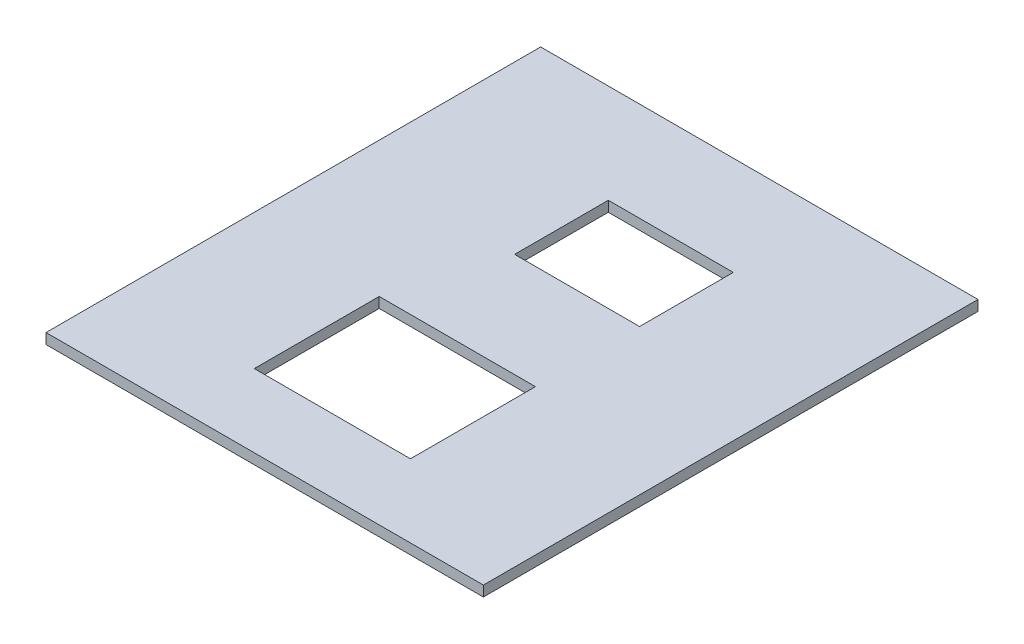
ISO-10303-21;
HEADER;
FILE_DESCRIPTION(('STEP AP214'),'2;1');
FILE_NAME('part.step','',(''),(''),'','','');
FILE_SCHEMA(('AUTOMOTIVE_DESIGN { 1 0 10303 214 1 1 1 1 }'));
ENDSEC;
DATA;
#1=APPLICATION_CONTEXT('core data for automotive mechanical design processes');
#2=APPLICATION_PROTOCOL_DEFINITION('international standard','automotive_design',2000,#1);
#3=PRODUCT_CONTEXT('',#1,'mechanical');
#4=PRODUCT('Part','Part','',(#3));
#5=PRODUCT_RELATED_PRODUCT_CATEGORY('part','',(#4));
#6=PRODUCT_DEFINITION_FORMATION('','',#4);
#7=PRODUCT_DEFINITION_CONTEXT('part definition',#1,'design');
#8=PRODUCT_DEFINITION('design','',#6,#7);
#9=PRODUCT_DEFINITION_SHAPE('','',#8);
#10=(LENGTH_UNIT() NAMED_UNIT(*) SI_UNIT(.MILLI.,.METRE.));
#11=(NAMED_UNIT(*) PLANE_ANGLE_UNIT() SI_UNIT($,.RADIAN.));
#12=(NAMED_UNIT(*) SI_UNIT($,.STERADIAN.) SOLID_ANGLE_UNIT());
#13=UNCERTAINTY_MEASURE_WITH_UNIT(LENGTH_MEASURE(1.E-05),#10,'distance_accuracy_value','');
#14=(GEOMETRIC_REPRESENTATION_CONTEXT(3) GLOBAL_UNCERTAINTY_ASSIGNED_CONTEXT((#13)) GLOBAL_UNIT_ASSIGNED_CONTEXT((#10,
#11,#12)) REPRESENTATION_CONTEXT('',''));
#15=CARTESIAN_POINT('',(0.,0.,0.));
#16=DIRECTION('',(0.,0.,1.));
#17=DIRECTION('',(1.,0.,0.));
#18=AXIS2_PLACEMENT_3D('',#15,#16,#17);
#19=CARTESIAN_POINT('',(0.,1.,0.));
#20=DIRECTION('',(0.,-1.,0.));
#21=DIRECTION('',(0.,0.,-1.));
#22=AXIS2_PLACEMENT_3D('',#19,#20,#21);
#23=PLANE('',#22);
#24=DIRECTION('',(0.,0.,1.));
#25=VECTOR('',#24,1.);
#26=CARTESIAN_POINT('',(-5.,1.,0.));
#27=LINE('',#26,#25);
#28=CARTESIAN_POINT('',(-5.,1.,-14.25));
#29=VERTEX_POINT('',#28);
#30=CARTESIAN_POINT('',(-5.,1.,-5.25));
#31=VERTEX_POINT('',#30);
#32=EDGE_CURVE('E183',#29,#31,#27,.T.);
#33=ORIENTED_EDGE('',*,*,#32,.F.);
#34=DIRECTION('',(-1.,0.,0.));
#35=VECTOR('',#34,1.);
#36=CARTESIAN_POINT('',(0.,1.,-14.25));
#37=LINE('',#36,#35);
#38=CARTESIAN_POINT('',(6.99999999999999,1.,-14.25));
#39=VERTEX_POINT('',#38);
#40=EDGE_CURVE('E135',#39,#29,#37,.T.);
#41=ORIENTED_EDGE('',*,*,#40,.F.);
#42=DIRECTION('',(0.,0.,-1.));
#43=VECTOR('',#42,1.);
#44=CARTESIAN_POINT('',(6.99999999999999,1.,0.));
#45=LINE('',#44,#43);
#46=CARTESIAN_POINT('',(6.99999999999999,1.,-5.25));
#47=VERTEX_POINT('',#46);
#48=EDGE_CURVE('E179',#47,#39,#45,.T.);
#49=ORIENTED_EDGE('',*,*,#48,.F.);
#50=DIRECTION('',(1.,0.,0.));
#51=VECTOR('',#50,1.);
#52=CARTESIAN_POINT('',(0.,1.,-5.25));
#53=LINE('',#52,#51);
#54=EDGE_CURVE('E181',#31,#47,#53,.T.);
#55=ORIENTED_EDGE('',*,*,#54,.F.);
#56=EDGE_LOOP('',(#33,#41,#49,#55));
#57=FACE_BOUND('',#56,.T.);
#58=DIRECTION('',(0.,0.,-1.));
#59=VECTOR('',#58,1.);
#60=CARTESIAN_POINT('',(21.,1.,23.75));
#61=LINE('',#60,#59);
#62=CARTESIAN_POINT('',(21.,1.,23.75));
#63=VERTEX_POINT('',#62);
#64=CARTESIAN_POINT('',(21.,1.,-23.75));
#65=VERTEX_POINT('',#64);
#66=EDGE_CURVE('E193',#63,#65,#61,.T.);
#67=ORIENTED_EDGE('',*,*,#66,.T.);
#68=DIRECTION('',(-1.,0.,0.));
#69=VECTOR('',#68,1.);
#70=CARTESIAN_POINT('',(-21.,1.,-23.75));
#71=LINE('',#70,#69);
#72=CARTESIAN_POINT('',(-21.,1.,-23.75));
#73=VERTEX_POINT('',#72);
#74=EDGE_CURVE('E196',#65,#73,#71,.T.);
#75=ORIENTED_EDGE('',*,*,#74,.T.);
#76=DIRECTION('',(0.,0.,1.));
#77=VECTOR('',#76,1.);
#78=CARTESIAN_POINT('',(-21.,1.,23.75));
#79=LINE('',#78,#77);
#80=CARTESIAN_POINT('',(-21.,1.,23.75));
#81=VERTEX_POINT('',#80);
#82=EDGE_CURVE('E199',#73,#81,#79,.T.);
#83=ORIENTED_EDGE('',*,*,#82,.T.);
#84=DIRECTION('',(1.,0.,0.));
#85=VECTOR('',#84,1.);
#86=CARTESIAN_POINT('',(-21.,1.,23.75));
#87=LINE('',#86,#85);
#88=EDGE_CURVE('E201',#81,#63,#87,.T.);
#89=ORIENTED_EDGE('',*,*,#88,.T.);
#90=EDGE_LOOP('',(#67,#75,#83,#89));
#91=FACE_BOUND('',#90,.T.);
#92=DIRECTION('',(0.,0.,1.));
#93=VECTOR('',#92,1.);
#94=CARTESIAN_POINT('',(-8.,1.,0.));
#95=LINE('',#94,#93);
#96=CARTESIAN_POINT('',(-8.,1.,4.75));
#97=VERTEX_POINT('',#96);
#98=CARTESIAN_POINT('',(-8.,1.,16.75));
#99=VERTEX_POINT('',#98);
#100=EDGE_CURVE('E132',#97,#99,#95,.T.);
#101=ORIENTED_EDGE('',*,*,#100,.F.);
#102=DIRECTION('',(-1.,0.,0.));
#103=VECTOR('',#102,1.);
#104=CARTESIAN_POINT('',(0.,1.,4.75));
#105=LINE('',#104,#103);
#106=CARTESIAN_POINT('',(7.,1.,4.75));
#107=VERTEX_POINT('',#106);
#108=EDGE_CURVE('E185',#107,#97,#105,.T.);
#109=ORIENTED_EDGE('',*,*,#108,.F.);
#110=DIRECTION('',(0.,0.,-1.));
#111=VECTOR('',#110,1.);
#112=CARTESIAN_POINT('',(7.,1.,0.));
#113=LINE('',#112,#111);
#114=CARTESIAN_POINT('',(7.,1.,16.75));
#115=VERTEX_POINT('',#114);
#116=EDGE_CURVE('E187',#115,#107,#113,.T.);
#117=ORIENTED_EDGE('',*,*,#116,.F.);
#118=DIRECTION('',(1.,0.,0.));
#119=VECTOR('',#118,1.);
#120=CARTESIAN_POINT('',(0.,1.,16.75));
#121=LINE('',#120,#119);
#122=EDGE_CURVE('E189',#99,#115,#121,.T.);
#123=ORIENTED_EDGE('',*,*,#122,.F.);
#124=EDGE_LOOP('',(#101,#109,#117,#123));
#125=FACE_BOUND('',#124,.T.);
#126=ADVANCED_FACE('F36',(#57,#91,#125),#23,.F.);
#127=CARTESIAN_POINT('',(0.,0.,0.));
#128=DIRECTION('',(0.,-1.,0.));
#129=DIRECTION('',(0.,0.,-1.));
#130=AXIS2_PLACEMENT_3D('',#127,#128,#129);
#131=PLANE('',#130);
#132=DIRECTION('',(0.,0.,-1.));
#133=VECTOR('',#132,1.);
#134=CARTESIAN_POINT('',(21.,0.,23.75));
#135=LINE('',#134,#133);
#136=CARTESIAN_POINT('',(21.,0.,23.75));
#137=VERTEX_POINT('',#136);
#138=CARTESIAN_POINT('',(21.,0.,-23.75));
#139=VERTEX_POINT('',#138);
#140=EDGE_CURVE('E192',#137,#139,#135,.T.);
#141=ORIENTED_EDGE('',*,*,#140,.F.);
#142=DIRECTION('',(1.,0.,0.));
#143=VECTOR('',#142,1.);
#144=CARTESIAN_POINT('',(-21.,0.,23.75));
#145=LINE('',#144,#143);
#146=CARTESIAN_POINT('',(-21.,0.,23.75));
#147=VERTEX_POINT('',#146);
#148=EDGE_CURVE('E197',#147,#137,#145,.T.);
#149=ORIENTED_EDGE('',*,*,#148,.F.);
#150=DIRECTION('',(0.,0.,1.));
#151=VECTOR('',#150,1.);
#152=CARTESIAN_POINT('',(-21.,0.,23.75));
#153=LINE('',#152,#151);
#154=CARTESIAN_POINT('',(-21.,0.,-23.75));
#155=VERTEX_POINT('',#154);
#156=EDGE_CURVE('E208',#155,#147,#153,.T.);
#157=ORIENTED_EDGE('',*,*,#156,.F.);
#158=DIRECTION('',(-1.,0.,0.));
#159=VECTOR('',#158,1.);
#160=CARTESIAN_POINT('',(-21.,0.,-23.75));
#161=LINE('',#160,#159);
#162=EDGE_CURVE('E206',#139,#155,#161,.T.);
#163=ORIENTED_EDGE('',*,*,#162,.F.);
#164=EDGE_LOOP('',(#141,#149,#157,#163));
#165=FACE_BOUND('',#164,.T.);
#166=DIRECTION('',(-1.,0.,0.));
#167=VECTOR('',#166,1.);
#168=CARTESIAN_POINT('',(-5.,0.,-14.25));
#169=LINE('',#168,#167);
#170=CARTESIAN_POINT('',(6.99999999999999,0.,-14.25));
#171=VERTEX_POINT('',#170);
#172=CARTESIAN_POINT('',(-5.,0.,-14.25));
#173=VERTEX_POINT('',#172);
#174=EDGE_CURVE('E170',#171,#173,#169,.T.);
#175=ORIENTED_EDGE('',*,*,#174,.T.);
#176=DIRECTION('',(0.,0.,1.));
#177=VECTOR('',#176,1.);
#178=CARTESIAN_POINT('',(-5.,0.,-5.25));
#179=LINE('',#178,#177);
#180=CARTESIAN_POINT('',(-5.,0.,-5.25));
#181=VERTEX_POINT('',#180);
#182=EDGE_CURVE('E161',#173,#181,#179,.T.);
#183=ORIENTED_EDGE('',*,*,#182,.T.);
#184=DIRECTION('',(1.,0.,0.));
#185=VECTOR('',#184,1.);
#186=CARTESIAN_POINT('',(-5.,0.,-5.25));
#187=LINE('',#186,#185);
#188=CARTESIAN_POINT('',(6.99999999999999,0.,-5.25));
#189=VERTEX_POINT('',#188);
#190=EDGE_CURVE('E164',#181,#189,#187,.T.);
#191=ORIENTED_EDGE('',*,*,#190,.T.);
#192=DIRECTION('',(0.,0.,-1.));
#193=VECTOR('',#192,1.);
#194=CARTESIAN_POINT('',(6.99999999999999,0.,-5.25));
#195=LINE('',#194,#193);
#196=EDGE_CURVE('E167',#189,#171,#195,.T.);
#197=ORIENTED_EDGE('',*,*,#196,.T.);
#198=EDGE_LOOP('',(#175,#183,#191,#197));
#199=FACE_BOUND('',#198,.T.);
#200=DIRECTION('',(-1.,0.,0.));
#201=VECTOR('',#200,1.);
#202=CARTESIAN_POINT('',(-8.,0.,4.75));
#203=LINE('',#202,#201);
#204=CARTESIAN_POINT('',(7.,0.,4.75));
#205=VERTEX_POINT('',#204);
#206=CARTESIAN_POINT('',(-8.,0.,4.75));
#207=VERTEX_POINT('',#206);
#208=EDGE_CURVE('E149',#205,#207,#203,.T.);
#209=ORIENTED_EDGE('',*,*,#208,.T.);
#210=DIRECTION('',(0.,0.,1.));
#211=VECTOR('',#210,1.);
#212=CARTESIAN_POINT('',(-8.,0.,16.75));
#213=LINE('',#212,#211);
#214=CARTESIAN_POINT('',(-8.,0.,16.75));
#215=VERTEX_POINT('',#214);
#216=EDGE_CURVE('E129',#207,#215,#213,.T.);
#217=ORIENTED_EDGE('',*,*,#216,.T.);
#218=DIRECTION('',(1.,0.,0.));
#219=VECTOR('',#218,1.);
#220=CARTESIAN_POINT('',(-8.,0.,16.75));
#221=LINE('',#220,#219);
#222=CARTESIAN_POINT('',(7.,0.,16.75));
#223=VERTEX_POINT('',#222);
#224=EDGE_CURVE('E139',#215,#223,#221,.T.);
#225=ORIENTED_EDGE('',*,*,#224,.T.);
#226=DIRECTION('',(0.,0.,-1.));
#227=VECTOR('',#226,1.);
#228=CARTESIAN_POINT('',(7.,0.,16.75));
#229=LINE('',#228,#227);
#230=EDGE_CURVE('E145',#223,#205,#229,.T.);
#231=ORIENTED_EDGE('',*,*,#230,.T.);
#232=EDGE_LOOP('',(#209,#217,#225,#231));
#233=FACE_BOUND('',#232,.T.);
#234=ADVANCED_FACE('F148',(#165,#199,#233),#131,.T.);
#235=CARTESIAN_POINT('',(21.,1.,23.75));
#236=DIRECTION('',(-1.,0.,0.));
#237=DIRECTION('',(0.,0.,1.));
#238=AXIS2_PLACEMENT_3D('',#235,#236,#237);
#239=PLANE('',#238);
#240=ORIENTED_EDGE('',*,*,#140,.T.);
#241=DIRECTION('',(0.,-1.,0.));
#242=VECTOR('',#241,1.);
#243=CARTESIAN_POINT('',(21.,1.,-23.75));
#244=LINE('',#243,#242);
#245=EDGE_CURVE('E11',#65,#139,#244,.T.);
#246=ORIENTED_EDGE('',*,*,#245,.F.);
#247=ORIENTED_EDGE('',*,*,#66,.F.);
#248=DIRECTION('',(0.,-1.,0.));
#249=VECTOR('',#248,1.);
#250=CARTESIAN_POINT('',(21.,1.,23.75));
#251=LINE('',#250,#249);
#252=EDGE_CURVE('E203',#63,#137,#251,.T.);
#253=ORIENTED_EDGE('',*,*,#252,.T.);
#254=EDGE_LOOP('',(#240,#246,#247,#253));
#255=FACE_BOUND('',#254,.T.);
#256=ADVANCED_FACE('F38',(#255),#239,.F.);
#257=CARTESIAN_POINT('',(-21.,1.,-23.75));
#258=DIRECTION('',(0.,0.,1.));
#259=DIRECTION('',(1.,0.,0.));
#260=AXIS2_PLACEMENT_3D('',#257,#258,#259);
#261=PLANE('',#260);
#262=ORIENTED_EDGE('',*,*,#162,.T.);
#263=DIRECTION('',(0.,-1.,0.));
#264=VECTOR('',#263,1.);
#265=CARTESIAN_POINT('',(-21.,1.,-23.75));
#266=LINE('',#265,#264);
#267=EDGE_CURVE('E44',#73,#155,#266,.T.);
#268=ORIENTED_EDGE('',*,*,#267,.F.);
#269=ORIENTED_EDGE('',*,*,#74,.F.);
#270=ORIENTED_EDGE('',*,*,#245,.T.);
#271=EDGE_LOOP('',(#262,#268,#269,#270));
#272=FACE_BOUND('',#271,.T.);
#273=ADVANCED_FACE('F236',(#272),#261,.F.);
#274=CARTESIAN_POINT('',(-21.,1.,23.75));
#275=DIRECTION('',(1.,0.,0.));
#276=DIRECTION('',(0.,0.,-1.));
#277=AXIS2_PLACEMENT_3D('',#274,#275,#276);
#278=PLANE('',#277);
#279=ORIENTED_EDGE('',*,*,#156,.T.);
#280=DIRECTION('',(0.,-1.,0.));
#281=VECTOR('',#280,1.);
#282=CARTESIAN_POINT('',(-21.,1.,23.75));
#283=LINE('',#282,#281);
#284=EDGE_CURVE('E213',#81,#147,#283,.T.);
#285=ORIENTED_EDGE('',*,*,#284,.F.);
#286=ORIENTED_EDGE('',*,*,#82,.F.);
#287=ORIENTED_EDGE('',*,*,#267,.T.);
#288=EDGE_LOOP('',(#279,#285,#286,#287));
#289=FACE_BOUND('',#288,.T.);
#290=ADVANCED_FACE('F220',(#289),#278,.F.);
#291=CARTESIAN_POINT('',(-21.,1.,23.75));
#292=DIRECTION('',(0.,0.,-1.));
#293=DIRECTION('',(-1.,0.,0.));
#294=AXIS2_PLACEMENT_3D('',#291,#292,#293);
#295=PLANE('',#294);
#296=ORIENTED_EDGE('',*,*,#148,.T.);
#297=ORIENTED_EDGE('',*,*,#252,.F.);
#298=ORIENTED_EDGE('',*,*,#88,.F.);
#299=ORIENTED_EDGE('',*,*,#284,.T.);
#300=EDGE_LOOP('',(#296,#297,#298,#299));
#301=FACE_BOUND('',#300,.T.);
#302=ADVANCED_FACE('F229',(#301),#295,.F.);
#303=CARTESIAN_POINT('',(-5.,25.,-5.25));
#304=DIRECTION('',(1.,0.,0.));
#305=DIRECTION('',(0.,0.,-1.));
#306=AXIS2_PLACEMENT_3D('',#303,#304,#305);
#307=PLANE('',#306);
#308=ORIENTED_EDGE('',*,*,#32,.T.);
#309=DIRECTION('',(0.,-1.,0.));
#310=VECTOR('',#309,1.);
#311=CARTESIAN_POINT('',(-5.,25.,-5.25));
#312=LINE('',#311,#310);
#313=EDGE_CURVE('E150',#31,#181,#312,.T.);
#314=ORIENTED_EDGE('',*,*,#313,.T.);
#315=ORIENTED_EDGE('',*,*,#182,.F.);
#316=DIRECTION('',(0.,-1.,0.));
#317=VECTOR('',#316,1.);
#318=CARTESIAN_POINT('',(-5.,25.,-14.25));
#319=LINE('',#318,#317);
#320=EDGE_CURVE('E173',#29,#173,#319,.T.);
#321=ORIENTED_EDGE('',*,*,#320,.F.);
#322=EDGE_LOOP('',(#308,#314,#315,#321));
#323=FACE_BOUND('',#322,.T.);
#324=ADVANCED_FACE('F252',(#323),#307,.T.);
#325=CARTESIAN_POINT('',(-5.,25.,-5.25));
#326=DIRECTION('',(0.,0.,-1.));
#327=DIRECTION('',(-1.,0.,0.));
#328=AXIS2_PLACEMENT_3D('',#325,#326,#327);
#329=PLANE('',#328);
#330=ORIENTED_EDGE('',*,*,#54,.T.);
#331=DIRECTION('',(0.,-1.,0.));
#332=VECTOR('',#331,1.);
#333=CARTESIAN_POINT('',(6.99999999999999,25.,-5.25));
#334=LINE('',#333,#332);
#335=EDGE_CURVE('E152',#47,#189,#334,.T.);
#336=ORIENTED_EDGE('',*,*,#335,.T.);
#337=ORIENTED_EDGE('',*,*,#190,.F.);
#338=ORIENTED_EDGE('',*,*,#313,.F.);
#339=EDGE_LOOP('',(#330,#336,#337,#338));
#340=FACE_BOUND('',#339,.T.);
#341=ADVANCED_FACE('F259',(#340),#329,.T.);
#342=CARTESIAN_POINT('',(6.99999999999999,25.,-5.25));
#343=DIRECTION('',(-1.,0.,0.));
#344=DIRECTION('',(0.,0.,1.));
#345=AXIS2_PLACEMENT_3D('',#342,#343,#344);
#346=PLANE('',#345);
#347=ORIENTED_EDGE('',*,*,#48,.T.);
#348=DIRECTION('',(0.,-1.,0.));
#349=VECTOR('',#348,1.);
#350=CARTESIAN_POINT('',(6.99999999999999,25.,-14.25));
#351=LINE('',#350,#349);
#352=EDGE_CURVE('E59',#39,#171,#351,.T.);
#353=ORIENTED_EDGE('',*,*,#352,.T.);
#354=ORIENTED_EDGE('',*,*,#196,.F.);
#355=ORIENTED_EDGE('',*,*,#335,.F.);
#356=EDGE_LOOP('',(#347,#353,#354,#355));
#357=FACE_BOUND('',#356,.T.);
#358=ADVANCED_FACE('F264',(#357),#346,.T.);
#359=CARTESIAN_POINT('',(-5.,25.,-14.25));
#360=DIRECTION('',(0.,0.,1.));
#361=DIRECTION('',(1.,0.,0.));
#362=AXIS2_PLACEMENT_3D('',#359,#360,#361);
#363=PLANE('',#362);
#364=ORIENTED_EDGE('',*,*,#40,.T.);
#365=ORIENTED_EDGE('',*,*,#320,.T.);
#366=ORIENTED_EDGE('',*,*,#174,.F.);
#367=ORIENTED_EDGE('',*,*,#352,.F.);
#368=EDGE_LOOP('',(#364,#365,#366,#367));
#369=FACE_BOUND('',#368,.T.);
#370=ADVANCED_FACE('F275',(#369),#363,.T.);
#371=CARTESIAN_POINT('',(-8.,25.,16.75));
#372=DIRECTION('',(1.,0.,0.));
#373=DIRECTION('',(0.,0.,-1.));
#374=AXIS2_PLACEMENT_3D('',#371,#372,#373);
#375=PLANE('',#374);
#376=ORIENTED_EDGE('',*,*,#100,.T.);
#377=DIRECTION('',(0.,-1.,0.));
#378=VECTOR('',#377,1.);
#379=CARTESIAN_POINT('',(-8.,25.,16.75));
#380=LINE('',#379,#378);
#381=EDGE_CURVE('E124',#99,#215,#380,.T.);
#382=ORIENTED_EDGE('',*,*,#381,.T.);
#383=ORIENTED_EDGE('',*,*,#216,.F.);
#384=DIRECTION('',(0.,-1.,0.));
#385=VECTOR('',#384,1.);
#386=CARTESIAN_POINT('',(-8.,25.,4.75));
#387=LINE('',#386,#385);
#388=EDGE_CURVE('E157',#97,#207,#387,.T.);
#389=ORIENTED_EDGE('',*,*,#388,.F.);
#390=EDGE_LOOP('',(#376,#382,#383,#389));
#391=FACE_BOUND('',#390,.T.);
#392=ADVANCED_FACE('F126',(#391),#375,.T.);
#393=CARTESIAN_POINT('',(-8.,25.,16.75));
#394=DIRECTION('',(0.,0.,-1.));
#395=DIRECTION('',(-1.,0.,0.));
#396=AXIS2_PLACEMENT_3D('',#393,#394,#395);
#397=PLANE('',#396);
#398=ORIENTED_EDGE('',*,*,#122,.T.);
#399=DIRECTION('',(0.,-1.,0.));
#400=VECTOR('',#399,1.);
#401=CARTESIAN_POINT('',(7.,25.,16.75));
#402=LINE('',#401,#400);
#403=EDGE_CURVE('E136',#115,#223,#402,.T.);
#404=ORIENTED_EDGE('',*,*,#403,.T.);
#405=ORIENTED_EDGE('',*,*,#224,.F.);
#406=ORIENTED_EDGE('',*,*,#381,.F.);
#407=EDGE_LOOP('',(#398,#404,#405,#406));
#408=FACE_BOUND('',#407,.T.);
#409=ADVANCED_FACE('F140',(#408),#397,.T.);
#410=CARTESIAN_POINT('',(7.,25.,16.75));
#411=DIRECTION('',(-1.,0.,0.));
#412=DIRECTION('',(0.,0.,1.));
#413=AXIS2_PLACEMENT_3D('',#410,#411,#412);
#414=PLANE('',#413);
#415=ORIENTED_EDGE('',*,*,#116,.T.);
#416=DIRECTION('',(0.,-1.,0.));
#417=VECTOR('',#416,1.);
#418=CARTESIAN_POINT('',(7.,25.,4.75));
#419=LINE('',#418,#417);
#420=EDGE_CURVE('E51',#107,#205,#419,.T.);
#421=ORIENTED_EDGE('',*,*,#420,.T.);
#422=ORIENTED_EDGE('',*,*,#230,.F.);
#423=ORIENTED_EDGE('',*,*,#403,.F.);
#424=EDGE_LOOP('',(#415,#421,#422,#423));
#425=FACE_BOUND('',#424,.T.);
#426=ADVANCED_FACE('F287',(#425),#414,.T.);
#427=CARTESIAN_POINT('',(-8.,25.,4.75));
#428=DIRECTION('',(0.,0.,1.));
#429=DIRECTION('',(1.,0.,0.));
#430=AXIS2_PLACEMENT_3D('',#427,#428,#429);
#431=PLANE('',#430);
#432=ORIENTED_EDGE('',*,*,#108,.T.);
#433=ORIENTED_EDGE('',*,*,#388,.T.);
#434=ORIENTED_EDGE('',*,*,#208,.F.);
#435=ORIENTED_EDGE('',*,*,#420,.F.);
#436=EDGE_LOOP('',(#432,#433,#434,#435));
#437=FACE_BOUND('',#436,.T.);
#438=ADVANCED_FACE('F290',(#437),#431,.T.);
#439=CLOSED_SHELL('',(#126,#234,#256,#273,#290,#302,#324,#341,#358,#370,#392,#409,#426,#438));
#440=MANIFOLD_SOLID_BREP('B2',#439);
#441=ADVANCED_BREP_SHAPE_REPRESENTATION('',(#18,#440),#14);
#442=SHAPE_DEFINITION_REPRESENTATION(#9,#441);
ENDSEC;
END-ISO-10303-21;
